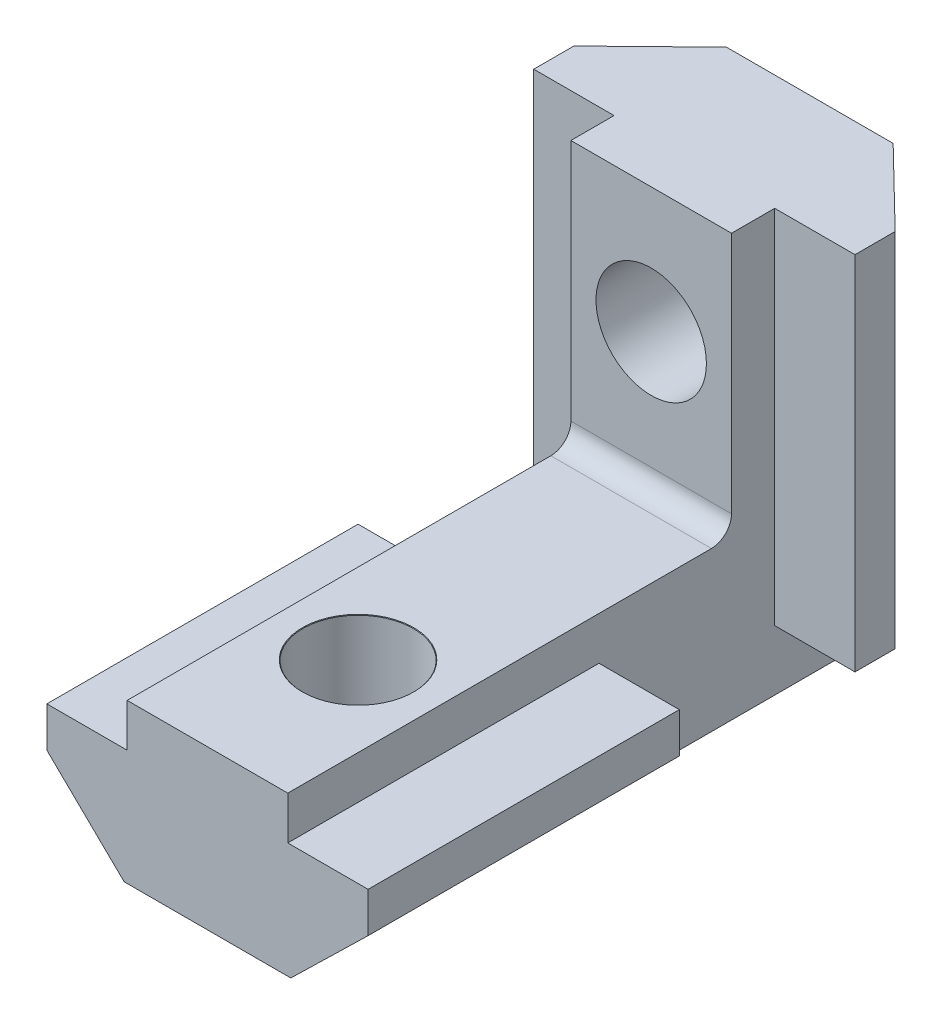
ISO-10303-21;
HEADER;
FILE_DESCRIPTION(('STEP AP214'),'2;1');
FILE_NAME('part.step','',(''),(''),'','','');
FILE_SCHEMA(('AUTOMOTIVE_DESIGN { 1 0 10303 214 1 1 1 1 }'));
ENDSEC;
DATA;
#1=APPLICATION_CONTEXT('core data for automotive mechanical design processes');
#2=APPLICATION_PROTOCOL_DEFINITION('international standard','automotive_design',2000,#1);
#3=PRODUCT_CONTEXT('',#1,'mechanical');
#4=PRODUCT('Part','Part','',(#3));
#5=PRODUCT_RELATED_PRODUCT_CATEGORY('part','',(#4));
#6=PRODUCT_DEFINITION_FORMATION('','',#4);
#7=PRODUCT_DEFINITION_CONTEXT('part definition',#1,'design');
#8=PRODUCT_DEFINITION('design','',#6,#7);
#9=PRODUCT_DEFINITION_SHAPE('','',#8);
#10=(LENGTH_UNIT() NAMED_UNIT(*) SI_UNIT(.MILLI.,.METRE.));
#11=(NAMED_UNIT(*) PLANE_ANGLE_UNIT() SI_UNIT($,.RADIAN.));
#12=(NAMED_UNIT(*) SI_UNIT($,.STERADIAN.) SOLID_ANGLE_UNIT());
#13=UNCERTAINTY_MEASURE_WITH_UNIT(LENGTH_MEASURE(1.E-05),#10,'distance_accuracy_value','');
#14=(GEOMETRIC_REPRESENTATION_CONTEXT(3) GLOBAL_UNCERTAINTY_ASSIGNED_CONTEXT((#13)) GLOBAL_UNIT_ASSIGNED_CONTEXT((#10,
#11,#12)) REPRESENTATION_CONTEXT('',''));
#15=CARTESIAN_POINT('',(0.,0.,0.));
#16=DIRECTION('',(0.,0.,1.));
#17=DIRECTION('',(1.,0.,0.));
#18=AXIS2_PLACEMENT_3D('',#15,#16,#17);
#19=CARTESIAN_POINT('',(-4.,7.9,-15.5));
#20=DIRECTION('',(-1.,0.,0.));
#21=DIRECTION('',(0.,0.,1.));
#22=AXIS2_PLACEMENT_3D('',#19,#20,#21);
#23=PLANE('',#22);
#24=DIRECTION('',(0.,0.,1.));
#25=VECTOR('',#24,1.);
#26=CARTESIAN_POINT('',(-4.,7.9,-15.5));
#27=LINE('',#26,#25);
#28=CARTESIAN_POINT('',(-4.,7.9,-21.1));
#29=VERTEX_POINT('',#28);
#30=CARTESIAN_POINT('',(-4.,7.9,0.));
#31=VERTEX_POINT('',#30);
#32=EDGE_CURVE('E303',#29,#31,#27,.T.);
#33=ORIENTED_EDGE('',*,*,#32,.F.);
#34=CARTESIAN_POINT('',(-4.,8.9,-21.1));
#35=DIRECTION('',(-1.,0.,0.));
#36=DIRECTION('',(0.,0.,1.));
#37=AXIS2_PLACEMENT_3D('',#34,#35,#36);
#38=CIRCLE('',#37,1.);
#39=CARTESIAN_POINT('',(-4.,8.9,-22.1));
#40=VERTEX_POINT('',#39);
#41=EDGE_CURVE('E41',#29,#40,#38,.F.);
#42=ORIENTED_EDGE('',*,*,#41,.T.);
#43=DIRECTION('',(0.,1.,0.));
#44=VECTOR('',#43,1.);
#45=CARTESIAN_POINT('',(-4.,-32.8440466262561,-22.1));
#46=LINE('',#45,#44);
#47=CARTESIAN_POINT('',(-4.,21.,-22.1));
#48=VERTEX_POINT('',#47);
#49=EDGE_CURVE('E245',#40,#48,#46,.T.);
#50=ORIENTED_EDGE('',*,*,#49,.T.);
#51=DIRECTION('',(0.,0.,-1.));
#52=VECTOR('',#51,1.);
#53=CARTESIAN_POINT('',(-4.,21.,-24.25));
#54=LINE('',#53,#52);
#55=CARTESIAN_POINT('',(-4.,21.,-24.25));
#56=VERTEX_POINT('',#55);
#57=EDGE_CURVE('E247',#48,#56,#54,.T.);
#58=ORIENTED_EDGE('',*,*,#57,.T.);
#59=DIRECTION('',(0.,1.,0.));
#60=VECTOR('',#59,1.);
#61=CARTESIAN_POINT('',(-4.,-32.8440466262561,-24.25));
#62=LINE('',#61,#60);
#63=CARTESIAN_POINT('',(-4.,3.,-24.25));
#64=VERTEX_POINT('',#63);
#65=EDGE_CURVE('E248',#64,#56,#62,.T.);
#66=ORIENTED_EDGE('',*,*,#65,.F.);
#67=DIRECTION('',(0.,0.,1.));
#68=VECTOR('',#67,1.);
#69=CARTESIAN_POINT('',(-4.,3.,-15.5));
#70=LINE('',#69,#68);
#71=CARTESIAN_POINT('',(-4.,3.,-30.));
#72=VERTEX_POINT('',#71);
#73=EDGE_CURVE('E216',#72,#64,#70,.T.);
#74=ORIENTED_EDGE('',*,*,#73,.F.);
#75=DIRECTION('',(0.,1.,0.));
#76=VECTOR('',#75,1.);
#77=CARTESIAN_POINT('',(-4.,0.,-30.));
#78=LINE('',#77,#76);
#79=CARTESIAN_POINT('',(-4.,0.,-30.));
#80=VERTEX_POINT('',#79);
#81=EDGE_CURVE('E203',#80,#72,#78,.T.);
#82=ORIENTED_EDGE('',*,*,#81,.F.);
#83=DIRECTION('',(0.,0.,1.));
#84=VECTOR('',#83,1.);
#85=CARTESIAN_POINT('',(-4.,0.,-30.));
#86=LINE('',#85,#84);
#87=CARTESIAN_POINT('',(-4.,0.,-15.5));
#88=VERTEX_POINT('',#87);
#89=EDGE_CURVE('E266',#80,#88,#86,.T.);
#90=ORIENTED_EDGE('',*,*,#89,.T.);
#91=DIRECTION('',(0.,1.,0.));
#92=VECTOR('',#91,1.);
#93=CARTESIAN_POINT('',(-4.,0.,-15.5));
#94=LINE('',#93,#92);
#95=CARTESIAN_POINT('',(-4.,5.75,-15.5));
#96=VERTEX_POINT('',#95);
#97=EDGE_CURVE('E260',#88,#96,#94,.T.);
#98=ORIENTED_EDGE('',*,*,#97,.T.);
#99=DIRECTION('',(0.,0.,1.));
#100=VECTOR('',#99,1.);
#101=CARTESIAN_POINT('',(-4.,5.75,-15.5));
#102=LINE('',#101,#100);
#103=CARTESIAN_POINT('',(-4.,5.75,0.));
#104=VERTEX_POINT('',#103);
#105=EDGE_CURVE('E300',#96,#104,#102,.T.);
#106=ORIENTED_EDGE('',*,*,#105,.T.);
#107=DIRECTION('',(0.,-1.,0.));
#108=VECTOR('',#107,1.);
#109=CARTESIAN_POINT('',(-4.,7.9,0.));
#110=LINE('',#109,#108);
#111=EDGE_CURVE('E326',#31,#104,#110,.T.);
#112=ORIENTED_EDGE('',*,*,#111,.F.);
#113=EDGE_LOOP('',(#33,#42,#50,#58,#66,#74,#82,#90,#98,#106,#112));
#114=FACE_BOUND('',#113,.T.);
#115=ADVANCED_FACE('F33',(#114),#23,.T.);
#116=CARTESIAN_POINT('',(4.,7.9,-15.5));
#117=DIRECTION('',(0.,1.,0.));
#118=DIRECTION('',(0.,0.,1.));
#119=AXIS2_PLACEMENT_3D('',#116,#117,#118);
#120=PLANE('',#119);
#121=CARTESIAN_POINT('',(0.,7.9,-7.5));
#122=DIRECTION('',(0.,1.,0.));
#123=DIRECTION('',(0.,0.,1.));
#124=AXIS2_PLACEMENT_3D('',#121,#122,#123);
#125=CIRCLE('',#124,2.775);
#126=CARTESIAN_POINT('',(0.,7.9,-4.725));
#127=VERTEX_POINT('',#126);
#128=EDGE_CURVE('E489',#127,#127,#125,.T.);
#129=ORIENTED_EDGE('',*,*,#128,.F.);
#130=EDGE_LOOP('',(#129));
#131=FACE_BOUND('',#130,.T.);
#132=DIRECTION('',(0.,0.,1.));
#133=VECTOR('',#132,1.);
#134=CARTESIAN_POINT('',(4.,7.9,-15.5));
#135=LINE('',#134,#133);
#136=CARTESIAN_POINT('',(4.,7.9,-21.1));
#137=VERTEX_POINT('',#136);
#138=CARTESIAN_POINT('',(4.,7.9,0.));
#139=VERTEX_POINT('',#138);
#140=EDGE_CURVE('E289',#137,#139,#135,.T.);
#141=ORIENTED_EDGE('',*,*,#140,.F.);
#142=DIRECTION('',(-1.,0.,0.));
#143=VECTOR('',#142,1.);
#144=CARTESIAN_POINT('',(4.,7.9,-21.1));
#145=LINE('',#144,#143);
#146=EDGE_CURVE('E276',#137,#29,#145,.T.);
#147=ORIENTED_EDGE('',*,*,#146,.T.);
#148=ORIENTED_EDGE('',*,*,#32,.T.);
#149=DIRECTION('',(-1.,0.,0.));
#150=VECTOR('',#149,1.);
#151=CARTESIAN_POINT('',(4.,7.9,0.));
#152=LINE('',#151,#150);
#153=EDGE_CURVE('E370',#139,#31,#152,.T.);
#154=ORIENTED_EDGE('',*,*,#153,.F.);
#155=EDGE_LOOP('',(#141,#147,#148,#154));
#156=FACE_BOUND('',#155,.T.);
#157=ADVANCED_FACE('F320',(#131,#156),#120,.T.);
#158=CARTESIAN_POINT('',(4.,5.75,-15.5));
#159=DIRECTION('',(1.,0.,0.));
#160=DIRECTION('',(0.,0.,-1.));
#161=AXIS2_PLACEMENT_3D('',#158,#159,#160);
#162=PLANE('',#161);
#163=DIRECTION('',(0.,1.,0.));
#164=VECTOR('',#163,1.);
#165=CARTESIAN_POINT('',(4.,-32.8440466262561,-24.25));
#166=LINE('',#165,#164);
#167=CARTESIAN_POINT('',(4.,3.,-24.25));
#168=VERTEX_POINT('',#167);
#169=CARTESIAN_POINT('',(4.,21.,-24.25));
#170=VERTEX_POINT('',#169);
#171=EDGE_CURVE('E239',#168,#170,#166,.T.);
#172=ORIENTED_EDGE('',*,*,#171,.T.);
#173=DIRECTION('',(0.,0.,1.));
#174=VECTOR('',#173,1.);
#175=CARTESIAN_POINT('',(4.,21.,-22.1));
#176=LINE('',#175,#174);
#177=CARTESIAN_POINT('',(4.,21.,-22.1));
#178=VERTEX_POINT('',#177);
#179=EDGE_CURVE('E241',#170,#178,#176,.T.);
#180=ORIENTED_EDGE('',*,*,#179,.T.);
#181=DIRECTION('',(0.,1.,0.));
#182=VECTOR('',#181,1.);
#183=CARTESIAN_POINT('',(4.,-32.8440466262561,-22.1));
#184=LINE('',#183,#182);
#185=CARTESIAN_POINT('',(4.,8.9,-22.1));
#186=VERTEX_POINT('',#185);
#187=EDGE_CURVE('E242',#186,#178,#184,.T.);
#188=ORIENTED_EDGE('',*,*,#187,.F.);
#189=CARTESIAN_POINT('',(4.,8.9,-21.1));
#190=DIRECTION('',(1.,0.,0.));
#191=DIRECTION('',(0.,0.,-1.));
#192=AXIS2_PLACEMENT_3D('',#189,#190,#191);
#193=CIRCLE('',#192,1.);
#194=EDGE_CURVE('E12',#186,#137,#193,.F.);
#195=ORIENTED_EDGE('',*,*,#194,.T.);
#196=ORIENTED_EDGE('',*,*,#140,.T.);
#197=DIRECTION('',(0.,1.,0.));
#198=VECTOR('',#197,1.);
#199=CARTESIAN_POINT('',(4.,5.75,0.));
#200=LINE('',#199,#198);
#201=CARTESIAN_POINT('',(4.,5.75,0.));
#202=VERTEX_POINT('',#201);
#203=EDGE_CURVE('E367',#202,#139,#200,.T.);
#204=ORIENTED_EDGE('',*,*,#203,.F.);
#205=DIRECTION('',(0.,0.,1.));
#206=VECTOR('',#205,1.);
#207=CARTESIAN_POINT('',(4.,5.75,-15.5));
#208=LINE('',#207,#206);
#209=CARTESIAN_POINT('',(4.,5.75,-15.5));
#210=VERTEX_POINT('',#209);
#211=EDGE_CURVE('E287',#210,#202,#208,.T.);
#212=ORIENTED_EDGE('',*,*,#211,.F.);
#213=DIRECTION('',(0.,-1.,0.));
#214=VECTOR('',#213,1.);
#215=CARTESIAN_POINT('',(4.,7.9,-15.5));
#216=LINE('',#215,#214);
#217=CARTESIAN_POINT('',(4.,0.,-15.5));
#218=VERTEX_POINT('',#217);
#219=EDGE_CURVE('E272',#210,#218,#216,.T.);
#220=ORIENTED_EDGE('',*,*,#219,.T.);
#221=DIRECTION('',(0.,0.,1.));
#222=VECTOR('',#221,1.);
#223=CARTESIAN_POINT('',(4.,0.,-30.));
#224=LINE('',#223,#222);
#225=CARTESIAN_POINT('',(4.,0.,-30.));
#226=VERTEX_POINT('',#225);
#227=EDGE_CURVE('E281',#226,#218,#224,.T.);
#228=ORIENTED_EDGE('',*,*,#227,.F.);
#229=DIRECTION('',(0.,-1.,0.));
#230=VECTOR('',#229,1.);
#231=CARTESIAN_POINT('',(4.,7.9,-30.));
#232=LINE('',#231,#230);
#233=CARTESIAN_POINT('',(4.,3.,-30.));
#234=VERTEX_POINT('',#233);
#235=EDGE_CURVE('E261',#234,#226,#232,.T.);
#236=ORIENTED_EDGE('',*,*,#235,.F.);
#237=DIRECTION('',(0.,0.,-1.));
#238=VECTOR('',#237,1.);
#239=CARTESIAN_POINT('',(4.,3.,-15.5));
#240=LINE('',#239,#238);
#241=EDGE_CURVE('E213',#168,#234,#240,.T.);
#242=ORIENTED_EDGE('',*,*,#241,.F.);
#243=EDGE_LOOP('',(#172,#180,#188,#195,#196,#204,#212,#220,#228,#236,#242));
#244=FACE_BOUND('',#243,.T.);
#245=ADVANCED_FACE('F406',(#244),#162,.T.);
#246=CARTESIAN_POINT('',(0.,0.,-15.5));
#247=DIRECTION('',(0.,0.,-1.));
#248=DIRECTION('',(-1.,0.,0.));
#249=AXIS2_PLACEMENT_3D('',#246,#247,#248);
#250=PLANE('',#249);
#251=ORIENTED_EDGE('',*,*,#97,.F.);
#252=DIRECTION('',(1.,0.,0.));
#253=VECTOR('',#252,1.);
#254=CARTESIAN_POINT('',(-4.15,0.,-15.5));
#255=LINE('',#254,#253);
#256=CARTESIAN_POINT('',(-4.15,0.,-15.5));
#257=VERTEX_POINT('',#256);
#258=EDGE_CURVE('E339',#257,#88,#255,.T.);
#259=ORIENTED_EDGE('',*,*,#258,.F.);
#260=DIRECTION('',(0.7163488096607,-0.697742347072111,0.));
#261=VECTOR('',#260,1.);
#262=CARTESIAN_POINT('',(-4.15,0.,-15.5));
#263=LINE('',#262,#261);
#264=CARTESIAN_POINT('',(-8.,3.75,-15.5));
#265=VERTEX_POINT('',#264);
#266=EDGE_CURVE('E345',#265,#257,#263,.T.);
#267=ORIENTED_EDGE('',*,*,#266,.F.);
#268=DIRECTION('',(0.,-1.,0.));
#269=VECTOR('',#268,1.);
#270=CARTESIAN_POINT('',(-8.,3.75,-15.5));
#271=LINE('',#270,#269);
#272=CARTESIAN_POINT('',(-8.,5.75,-15.5));
#273=VERTEX_POINT('',#272);
#274=EDGE_CURVE('E308',#273,#265,#271,.T.);
#275=ORIENTED_EDGE('',*,*,#274,.F.);
#276=DIRECTION('',(-1.,0.,0.));
#277=VECTOR('',#276,1.);
#278=CARTESIAN_POINT('',(-4.,5.75,-15.5));
#279=LINE('',#278,#277);
#280=EDGE_CURVE('E296',#96,#273,#279,.T.);
#281=ORIENTED_EDGE('',*,*,#280,.F.);
#282=EDGE_LOOP('',(#251,#259,#267,#275,#281));
#283=FACE_BOUND('',#282,.T.);
#284=ADVANCED_FACE('F398',(#283),#250,.T.);
#285=CARTESIAN_POINT('',(-4.15,0.,-15.5));
#286=DIRECTION('',(-0.697742347072111,-0.7163488096607,0.));
#287=DIRECTION('',(0.7163488096607,-0.697742347072111,0.));
#288=AXIS2_PLACEMENT_3D('',#285,#286,#287);
#289=PLANE('',#288);
#290=DIRECTION('',(0.7163488096607,-0.697742347072111,0.));
#291=VECTOR('',#290,1.);
#292=CARTESIAN_POINT('',(-4.15,0.,0.));
#293=LINE('',#292,#291);
#294=CARTESIAN_POINT('',(-8.,3.75,0.));
#295=VERTEX_POINT('',#294);
#296=CARTESIAN_POINT('',(-4.15,0.,0.));
#297=VERTEX_POINT('',#296);
#298=EDGE_CURVE('E284',#295,#297,#293,.T.);
#299=ORIENTED_EDGE('',*,*,#298,.F.);
#300=DIRECTION('',(0.,0.,1.));
#301=VECTOR('',#300,1.);
#302=CARTESIAN_POINT('',(-8.,3.75,-15.5));
#303=LINE('',#302,#301);
#304=EDGE_CURVE('E277',#265,#295,#303,.T.);
#305=ORIENTED_EDGE('',*,*,#304,.F.);
#306=ORIENTED_EDGE('',*,*,#266,.T.);
#307=DIRECTION('',(0.,0.,1.));
#308=VECTOR('',#307,1.);
#309=CARTESIAN_POINT('',(-4.15,0.,-15.5));
#310=LINE('',#309,#308);
#311=EDGE_CURVE('E338',#257,#297,#310,.T.);
#312=ORIENTED_EDGE('',*,*,#311,.T.);
#313=EDGE_LOOP('',(#299,#305,#306,#312));
#314=FACE_BOUND('',#313,.T.);
#315=ADVANCED_FACE('F390',(#314),#289,.T.);
#316=CARTESIAN_POINT('',(-8.,3.75,-15.5));
#317=DIRECTION('',(-1.,0.,0.));
#318=DIRECTION('',(0.,0.,1.));
#319=AXIS2_PLACEMENT_3D('',#316,#317,#318);
#320=PLANE('',#319);
#321=DIRECTION('',(0.,-1.,0.));
#322=VECTOR('',#321,1.);
#323=CARTESIAN_POINT('',(-8.,3.75,0.));
#324=LINE('',#323,#322);
#325=CARTESIAN_POINT('',(-8.,5.75,0.));
#326=VERTEX_POINT('',#325);
#327=EDGE_CURVE('E376',#326,#295,#324,.T.);
#328=ORIENTED_EDGE('',*,*,#327,.F.);
#329=DIRECTION('',(0.,0.,1.));
#330=VECTOR('',#329,1.);
#331=CARTESIAN_POINT('',(-8.,5.75,-15.5));
#332=LINE('',#331,#330);
#333=EDGE_CURVE('E302',#273,#326,#332,.T.);
#334=ORIENTED_EDGE('',*,*,#333,.F.);
#335=ORIENTED_EDGE('',*,*,#274,.T.);
#336=ORIENTED_EDGE('',*,*,#304,.T.);
#337=EDGE_LOOP('',(#328,#334,#335,#336));
#338=FACE_BOUND('',#337,.T.);
#339=ADVANCED_FACE('F388',(#338),#320,.T.);
#340=CARTESIAN_POINT('',(-4.,5.75,-15.5));
#341=DIRECTION('',(0.,1.,0.));
#342=DIRECTION('',(0.,0.,1.));
#343=AXIS2_PLACEMENT_3D('',#340,#341,#342);
#344=PLANE('',#343);
#345=DIRECTION('',(-1.,0.,0.));
#346=VECTOR('',#345,1.);
#347=CARTESIAN_POINT('',(-4.,5.75,0.));
#348=LINE('',#347,#346);
#349=EDGE_CURVE('E373',#104,#326,#348,.T.);
#350=ORIENTED_EDGE('',*,*,#349,.F.);
#351=ORIENTED_EDGE('',*,*,#105,.F.);
#352=ORIENTED_EDGE('',*,*,#280,.T.);
#353=ORIENTED_EDGE('',*,*,#333,.T.);
#354=EDGE_LOOP('',(#350,#351,#352,#353));
#355=FACE_BOUND('',#354,.T.);
#356=ADVANCED_FACE('F383',(#355),#344,.T.);
#357=CARTESIAN_POINT('',(8.,5.75,-15.5));
#358=DIRECTION('',(0.,1.,0.));
#359=DIRECTION('',(0.,0.,1.));
#360=AXIS2_PLACEMENT_3D('',#357,#358,#359);
#361=PLANE('',#360);
#362=DIRECTION('',(-1.,0.,0.));
#363=VECTOR('',#362,1.);
#364=CARTESIAN_POINT('',(8.,5.75,0.));
#365=LINE('',#364,#363);
#366=CARTESIAN_POINT('',(8.,5.75,0.));
#367=VERTEX_POINT('',#366);
#368=EDGE_CURVE('E364',#367,#202,#365,.T.);
#369=ORIENTED_EDGE('',*,*,#368,.F.);
#370=DIRECTION('',(0.,0.,1.));
#371=VECTOR('',#370,1.);
#372=CARTESIAN_POINT('',(8.,5.75,-15.5));
#373=LINE('',#372,#371);
#374=CARTESIAN_POINT('',(8.,5.75,-15.5));
#375=VERTEX_POINT('',#374);
#376=EDGE_CURVE('E290',#375,#367,#373,.T.);
#377=ORIENTED_EDGE('',*,*,#376,.F.);
#378=DIRECTION('',(-1.,0.,0.));
#379=VECTOR('',#378,1.);
#380=CARTESIAN_POINT('',(8.,5.75,-15.5));
#381=LINE('',#380,#379);
#382=EDGE_CURVE('E293',#375,#210,#381,.T.);
#383=ORIENTED_EDGE('',*,*,#382,.T.);
#384=ORIENTED_EDGE('',*,*,#211,.T.);
#385=EDGE_LOOP('',(#369,#377,#383,#384));
#386=FACE_BOUND('',#385,.T.);
#387=ADVANCED_FACE('F396',(#386),#361,.T.);
#388=CARTESIAN_POINT('',(8.,3.75,-15.5));
#389=DIRECTION('',(1.,0.,0.));
#390=DIRECTION('',(0.,0.,-1.));
#391=AXIS2_PLACEMENT_3D('',#388,#389,#390);
#392=PLANE('',#391);
#393=DIRECTION('',(0.,1.,0.));
#394=VECTOR('',#393,1.);
#395=CARTESIAN_POINT('',(8.,3.75,0.));
#396=LINE('',#395,#394);
#397=CARTESIAN_POINT('',(8.,3.75,0.));
#398=VERTEX_POINT('',#397);
#399=EDGE_CURVE('E361',#398,#367,#396,.T.);
#400=ORIENTED_EDGE('',*,*,#399,.F.);
#401=DIRECTION('',(0.,0.,1.));
#402=VECTOR('',#401,1.);
#403=CARTESIAN_POINT('',(8.,3.75,-15.5));
#404=LINE('',#403,#402);
#405=CARTESIAN_POINT('',(8.,3.75,-15.5));
#406=VERTEX_POINT('',#405);
#407=EDGE_CURVE('E334',#406,#398,#404,.T.);
#408=ORIENTED_EDGE('',*,*,#407,.F.);
#409=DIRECTION('',(0.,1.,0.));
#410=VECTOR('',#409,1.);
#411=CARTESIAN_POINT('',(8.,3.75,-15.5));
#412=LINE('',#411,#410);
#413=EDGE_CURVE('E297',#406,#375,#412,.T.);
#414=ORIENTED_EDGE('',*,*,#413,.T.);
#415=ORIENTED_EDGE('',*,*,#376,.T.);
#416=EDGE_LOOP('',(#400,#408,#414,#415));
#417=FACE_BOUND('',#416,.T.);
#418=ADVANCED_FACE('F415',(#417),#392,.T.);
#419=CARTESIAN_POINT('',(4.15,0.,-15.5));
#420=DIRECTION('',(0.697742347072111,-0.7163488096607,0.));
#421=DIRECTION('',(0.7163488096607,0.697742347072111,0.));
#422=AXIS2_PLACEMENT_3D('',#419,#420,#421);
#423=PLANE('',#422);
#424=DIRECTION('',(0.7163488096607,0.697742347072111,0.));
#425=VECTOR('',#424,1.);
#426=CARTESIAN_POINT('',(4.15,0.,0.));
#427=LINE('',#426,#425);
#428=CARTESIAN_POINT('',(4.15,0.,0.));
#429=VERTEX_POINT('',#428);
#430=EDGE_CURVE('E358',#429,#398,#427,.T.);
#431=ORIENTED_EDGE('',*,*,#430,.F.);
#432=DIRECTION('',(0.,0.,1.));
#433=VECTOR('',#432,1.);
#434=CARTESIAN_POINT('',(4.15,0.,-15.5));
#435=LINE('',#434,#433);
#436=CARTESIAN_POINT('',(4.15,0.,-15.5));
#437=VERTEX_POINT('',#436);
#438=EDGE_CURVE('E336',#437,#429,#435,.T.);
#439=ORIENTED_EDGE('',*,*,#438,.F.);
#440=DIRECTION('',(0.7163488096607,0.697742347072111,0.));
#441=VECTOR('',#440,1.);
#442=CARTESIAN_POINT('',(4.15,0.,-15.5));
#443=LINE('',#442,#441);
#444=EDGE_CURVE('E341',#437,#406,#443,.T.);
#445=ORIENTED_EDGE('',*,*,#444,.T.);
#446=ORIENTED_EDGE('',*,*,#407,.T.);
#447=EDGE_LOOP('',(#431,#439,#445,#446));
#448=FACE_BOUND('',#447,.T.);
#449=ADVANCED_FACE('F419',(#448),#423,.T.);
#450=CARTESIAN_POINT('',(-4.15,0.,-15.5));
#451=DIRECTION('',(0.,-1.,0.));
#452=DIRECTION('',(0.,0.,-1.));
#453=AXIS2_PLACEMENT_3D('',#450,#451,#452);
#454=PLANE('',#453);
#455=CARTESIAN_POINT('',(0.,0.,-7.5));
#456=DIRECTION('',(0.,-1.,0.));
#457=DIRECTION('',(0.,0.,-1.));
#458=AXIS2_PLACEMENT_3D('',#455,#456,#457);
#459=CIRCLE('',#458,2.75);
#460=CARTESIAN_POINT('',(0.,0.,-10.25));
#461=VERTEX_POINT('',#460);
#462=EDGE_CURVE('E257',#461,#461,#459,.T.);
#463=ORIENTED_EDGE('',*,*,#462,.F.);
#464=EDGE_LOOP('',(#463));
#465=FACE_BOUND('',#464,.T.);
#466=DIRECTION('',(1.,0.,0.));
#467=VECTOR('',#466,1.);
#468=CARTESIAN_POINT('',(-4.15,0.,0.));
#469=LINE('',#468,#467);
#470=EDGE_CURVE('E355',#297,#429,#469,.T.);
#471=ORIENTED_EDGE('',*,*,#470,.F.);
#472=ORIENTED_EDGE('',*,*,#311,.F.);
#473=ORIENTED_EDGE('',*,*,#258,.T.);
#474=ORIENTED_EDGE('',*,*,#89,.F.);
#475=DIRECTION('',(-1.,0.,0.));
#476=VECTOR('',#475,1.);
#477=CARTESIAN_POINT('',(4.,0.,-30.));
#478=LINE('',#477,#476);
#479=EDGE_CURVE('E263',#226,#80,#478,.T.);
#480=ORIENTED_EDGE('',*,*,#479,.F.);
#481=ORIENTED_EDGE('',*,*,#227,.T.);
#482=EDGE_CURVE('E278',#218,#437,#255,.T.);
#483=ORIENTED_EDGE('',*,*,#482,.T.);
#484=ORIENTED_EDGE('',*,*,#438,.T.);
#485=EDGE_LOOP('',(#471,#472,#473,#474,#480,#481,#483,#484));
#486=FACE_BOUND('',#485,.T.);
#487=ADVANCED_FACE('F423',(#465,#486),#454,.T.);
#488=ORIENTED_EDGE('',*,*,#219,.F.);
#489=ORIENTED_EDGE('',*,*,#382,.F.);
#490=ORIENTED_EDGE('',*,*,#413,.F.);
#491=ORIENTED_EDGE('',*,*,#444,.F.);
#492=ORIENTED_EDGE('',*,*,#482,.F.);
#493=EDGE_LOOP('',(#488,#489,#490,#491,#492));
#494=FACE_BOUND('',#493,.T.);
#495=ADVANCED_FACE('F426',(#494),#250,.T.);
#496=CARTESIAN_POINT('',(0.,0.,0.));
#497=DIRECTION('',(0.,0.,-1.));
#498=DIRECTION('',(-1.,0.,0.));
#499=AXIS2_PLACEMENT_3D('',#496,#497,#498);
#500=PLANE('',#499);
#501=ORIENTED_EDGE('',*,*,#298,.T.);
#502=ORIENTED_EDGE('',*,*,#470,.T.);
#503=ORIENTED_EDGE('',*,*,#430,.T.);
#504=ORIENTED_EDGE('',*,*,#399,.T.);
#505=ORIENTED_EDGE('',*,*,#368,.T.);
#506=ORIENTED_EDGE('',*,*,#203,.T.);
#507=ORIENTED_EDGE('',*,*,#153,.T.);
#508=ORIENTED_EDGE('',*,*,#111,.T.);
#509=ORIENTED_EDGE('',*,*,#349,.T.);
#510=ORIENTED_EDGE('',*,*,#327,.T.);
#511=EDGE_LOOP('',(#501,#502,#503,#504,#505,#506,#507,#508,#509,#510));
#512=FACE_BOUND('',#511,.T.);
#513=ADVANCED_FACE('F387',(#512),#500,.F.);
#514=CARTESIAN_POINT('',(0.,0.,-30.));
#515=DIRECTION('',(0.,0.,-1.));
#516=DIRECTION('',(-1.,0.,0.));
#517=AXIS2_PLACEMENT_3D('',#514,#515,#516);
#518=PLANE('',#517);
#519=CARTESIAN_POINT('',(0.,14.75,-30.));
#520=DIRECTION('',(0.,0.,-1.));
#521=DIRECTION('',(-1.,0.,0.));
#522=AXIS2_PLACEMENT_3D('',#519,#520,#521);
#523=CIRCLE('',#522,2.75);
#524=CARTESIAN_POINT('',(-2.75,14.75,-30.));
#525=VERTEX_POINT('',#524);
#526=EDGE_CURVE('E487',#525,#525,#523,.T.);
#527=ORIENTED_EDGE('',*,*,#526,.F.);
#528=EDGE_LOOP('',(#527));
#529=FACE_BOUND('',#528,.T.);
#530=ORIENTED_EDGE('',*,*,#81,.T.);
#531=DIRECTION('',(1.,0.,0.));
#532=VECTOR('',#531,1.);
#533=CARTESIAN_POINT('',(4.15,3.,-30.));
#534=LINE('',#533,#532);
#535=CARTESIAN_POINT('',(-4.15,3.,-30.));
#536=VERTEX_POINT('',#535);
#537=EDGE_CURVE('E200',#536,#72,#534,.T.);
#538=ORIENTED_EDGE('',*,*,#537,.F.);
#539=DIRECTION('',(0.,1.,0.));
#540=VECTOR('',#539,1.);
#541=CARTESIAN_POINT('',(-4.15,-32.8440466262561,-30.));
#542=LINE('',#541,#540);
#543=CARTESIAN_POINT('',(-4.15,21.,-30.));
#544=VERTEX_POINT('',#543);
#545=EDGE_CURVE('E185',#536,#544,#542,.T.);
#546=ORIENTED_EDGE('',*,*,#545,.T.);
#547=DIRECTION('',(1.,0.,0.));
#548=VECTOR('',#547,1.);
#549=CARTESIAN_POINT('',(4.15,21.,-30.));
#550=LINE('',#549,#548);
#551=CARTESIAN_POINT('',(4.15,21.,-30.));
#552=VERTEX_POINT('',#551);
#553=EDGE_CURVE('E196',#544,#552,#550,.T.);
#554=ORIENTED_EDGE('',*,*,#553,.T.);
#555=DIRECTION('',(0.,1.,0.));
#556=VECTOR('',#555,1.);
#557=CARTESIAN_POINT('',(4.15,-32.8440466262561,-30.));
#558=LINE('',#557,#556);
#559=CARTESIAN_POINT('',(4.15,3.,-30.));
#560=VERTEX_POINT('',#559);
#561=EDGE_CURVE('E256',#560,#552,#558,.T.);
#562=ORIENTED_EDGE('',*,*,#561,.F.);
#563=EDGE_CURVE('E207',#234,#560,#534,.T.);
#564=ORIENTED_EDGE('',*,*,#563,.F.);
#565=ORIENTED_EDGE('',*,*,#235,.T.);
#566=ORIENTED_EDGE('',*,*,#479,.T.);
#567=EDGE_LOOP('',(#530,#538,#546,#554,#562,#564,#565,#566));
#568=FACE_BOUND('',#567,.T.);
#569=ADVANCED_FACE('F201',(#529,#568),#518,.T.);
#570=CARTESIAN_POINT('',(0.,3.,0.));
#571=DIRECTION('',(0.,-1.,0.));
#572=DIRECTION('',(0.,0.,-1.));
#573=AXIS2_PLACEMENT_3D('',#570,#571,#572);
#574=PLANE('',#573);
#575=ORIENTED_EDGE('',*,*,#537,.T.);
#576=ORIENTED_EDGE('',*,*,#73,.T.);
#577=DIRECTION('',(-1.,0.,0.));
#578=VECTOR('',#577,1.);
#579=CARTESIAN_POINT('',(-8.,3.,-24.25));
#580=LINE('',#579,#578);
#581=CARTESIAN_POINT('',(-8.,3.,-24.25));
#582=VERTEX_POINT('',#581);
#583=EDGE_CURVE('E218',#64,#582,#580,.T.);
#584=ORIENTED_EDGE('',*,*,#583,.T.);
#585=DIRECTION('',(0.,0.,-1.));
#586=VECTOR('',#585,1.);
#587=CARTESIAN_POINT('',(-8.,3.,-24.25));
#588=LINE('',#587,#586);
#589=CARTESIAN_POINT('',(-8.,3.,-26.25));
#590=VERTEX_POINT('',#589);
#591=EDGE_CURVE('E212',#582,#590,#588,.T.);
#592=ORIENTED_EDGE('',*,*,#591,.T.);
#593=DIRECTION('',(0.7163488096607,0.,-0.697742347072111));
#594=VECTOR('',#593,1.);
#595=CARTESIAN_POINT('',(-4.15,3.,-30.));
#596=LINE('',#595,#594);
#597=EDGE_CURVE('E189',#590,#536,#596,.T.);
#598=ORIENTED_EDGE('',*,*,#597,.T.);
#599=EDGE_LOOP('',(#575,#576,#584,#592,#598));
#600=FACE_BOUND('',#599,.T.);
#601=ADVANCED_FACE('F210',(#600),#574,.T.);
#602=CARTESIAN_POINT('',(4.15,-32.8440466262561,-30.));
#603=DIRECTION('',(-0.697742347072111,0.,0.7163488096607));
#604=DIRECTION('',(0.7163488096607,0.,0.697742347072111));
#605=AXIS2_PLACEMENT_3D('',#602,#603,#604);
#606=PLANE('',#605);
#607=DIRECTION('',(0.7163488096607,0.,0.697742347072111));
#608=VECTOR('',#607,1.);
#609=CARTESIAN_POINT('',(4.15,3.,-30.));
#610=LINE('',#609,#608);
#611=CARTESIAN_POINT('',(8.,3.,-26.25));
#612=VERTEX_POINT('',#611);
#613=EDGE_CURVE('E206',#560,#612,#610,.T.);
#614=ORIENTED_EDGE('',*,*,#613,.F.);
#615=ORIENTED_EDGE('',*,*,#561,.T.);
#616=DIRECTION('',(0.7163488096607,0.,0.697742347072111));
#617=VECTOR('',#616,1.);
#618=CARTESIAN_POINT('',(4.15,21.,-30.));
#619=LINE('',#618,#617);
#620=CARTESIAN_POINT('',(8.,21.,-26.25));
#621=VERTEX_POINT('',#620);
#622=EDGE_CURVE('E221',#552,#621,#619,.T.);
#623=ORIENTED_EDGE('',*,*,#622,.T.);
#624=DIRECTION('',(0.,1.,0.));
#625=VECTOR('',#624,1.);
#626=CARTESIAN_POINT('',(8.,-32.8440466262561,-26.25));
#627=LINE('',#626,#625);
#628=EDGE_CURVE('E233',#612,#621,#627,.T.);
#629=ORIENTED_EDGE('',*,*,#628,.F.);
#630=EDGE_LOOP('',(#614,#615,#623,#629));
#631=FACE_BOUND('',#630,.T.);
#632=ADVANCED_FACE('F474',(#631),#606,.F.);
#633=CARTESIAN_POINT('',(8.,-32.8440466262561,-24.25));
#634=DIRECTION('',(-1.,0.,0.));
#635=DIRECTION('',(0.,0.,1.));
#636=AXIS2_PLACEMENT_3D('',#633,#634,#635);
#637=PLANE('',#636);
#638=DIRECTION('',(0.,0.,1.));
#639=VECTOR('',#638,1.);
#640=CARTESIAN_POINT('',(8.,3.,-24.25));
#641=LINE('',#640,#639);
#642=CARTESIAN_POINT('',(8.,3.,-24.25));
#643=VERTEX_POINT('',#642);
#644=EDGE_CURVE('E228',#612,#643,#641,.T.);
#645=ORIENTED_EDGE('',*,*,#644,.F.);
#646=ORIENTED_EDGE('',*,*,#628,.T.);
#647=DIRECTION('',(0.,0.,1.));
#648=VECTOR('',#647,1.);
#649=CARTESIAN_POINT('',(8.,21.,-24.25));
#650=LINE('',#649,#648);
#651=CARTESIAN_POINT('',(8.,21.,-24.25));
#652=VERTEX_POINT('',#651);
#653=EDGE_CURVE('E235',#621,#652,#650,.T.);
#654=ORIENTED_EDGE('',*,*,#653,.T.);
#655=DIRECTION('',(0.,1.,0.));
#656=VECTOR('',#655,1.);
#657=CARTESIAN_POINT('',(8.,-32.8440466262561,-24.25));
#658=LINE('',#657,#656);
#659=EDGE_CURVE('E236',#643,#652,#658,.T.);
#660=ORIENTED_EDGE('',*,*,#659,.F.);
#661=EDGE_LOOP('',(#645,#646,#654,#660));
#662=FACE_BOUND('',#661,.T.);
#663=ADVANCED_FACE('F479',(#662),#637,.F.);
#664=CARTESIAN_POINT('',(4.,-32.8440466262561,-24.25));
#665=DIRECTION('',(0.,0.,-1.));
#666=DIRECTION('',(-1.,0.,0.));
#667=AXIS2_PLACEMENT_3D('',#664,#665,#666);
#668=PLANE('',#667);
#669=DIRECTION('',(-1.,0.,0.));
#670=VECTOR('',#669,1.);
#671=CARTESIAN_POINT('',(4.,3.,-24.25));
#672=LINE('',#671,#670);
#673=EDGE_CURVE('E225',#643,#168,#672,.T.);
#674=ORIENTED_EDGE('',*,*,#673,.F.);
#675=ORIENTED_EDGE('',*,*,#659,.T.);
#676=DIRECTION('',(-1.,0.,0.));
#677=VECTOR('',#676,1.);
#678=CARTESIAN_POINT('',(4.,21.,-24.25));
#679=LINE('',#678,#677);
#680=EDGE_CURVE('E238',#652,#170,#679,.T.);
#681=ORIENTED_EDGE('',*,*,#680,.T.);
#682=ORIENTED_EDGE('',*,*,#171,.F.);
#683=EDGE_LOOP('',(#674,#675,#681,#682));
#684=FACE_BOUND('',#683,.T.);
#685=ADVANCED_FACE('F525',(#684),#668,.F.);
#686=CARTESIAN_POINT('',(-4.,-32.8440466262561,-22.1));
#687=DIRECTION('',(0.,0.,-1.));
#688=DIRECTION('',(-1.,0.,0.));
#689=AXIS2_PLACEMENT_3D('',#686,#687,#688);
#690=PLANE('',#689);
#691=CARTESIAN_POINT('',(0.,14.75,-22.1));
#692=DIRECTION('',(0.,0.,1.));
#693=DIRECTION('',(1.,0.,0.));
#694=AXIS2_PLACEMENT_3D('',#691,#692,#693);
#695=CIRCLE('',#694,2.75);
#696=CARTESIAN_POINT('',(2.75,14.75,-22.1));
#697=VERTEX_POINT('',#696);
#698=EDGE_CURVE('E490',#697,#697,#695,.T.);
#699=ORIENTED_EDGE('',*,*,#698,.F.);
#700=EDGE_LOOP('',(#699));
#701=FACE_BOUND('',#700,.T.);
#702=ORIENTED_EDGE('',*,*,#49,.F.);
#703=DIRECTION('',(-1.,0.,0.));
#704=VECTOR('',#703,1.);
#705=CARTESIAN_POINT('',(-4.,8.9,-22.1));
#706=LINE('',#705,#704);
#707=EDGE_CURVE('E54',#40,#186,#706,.F.);
#708=ORIENTED_EDGE('',*,*,#707,.T.);
#709=ORIENTED_EDGE('',*,*,#187,.T.);
#710=DIRECTION('',(-1.,0.,0.));
#711=VECTOR('',#710,1.);
#712=CARTESIAN_POINT('',(-4.,21.,-22.1));
#713=LINE('',#712,#711);
#714=EDGE_CURVE('E244',#178,#48,#713,.T.);
#715=ORIENTED_EDGE('',*,*,#714,.T.);
#716=EDGE_LOOP('',(#702,#708,#709,#715));
#717=FACE_BOUND('',#716,.T.);
#718=ADVANCED_FACE('F540',(#701,#717),#690,.F.);
#719=CARTESIAN_POINT('',(-8.,-32.8440466262561,-24.25));
#720=DIRECTION('',(0.,0.,-1.));
#721=DIRECTION('',(-1.,0.,0.));
#722=AXIS2_PLACEMENT_3D('',#719,#720,#721);
#723=PLANE('',#722);
#724=ORIENTED_EDGE('',*,*,#583,.F.);
#725=ORIENTED_EDGE('',*,*,#65,.T.);
#726=DIRECTION('',(-1.,0.,0.));
#727=VECTOR('',#726,1.);
#728=CARTESIAN_POINT('',(-8.,21.,-24.25));
#729=LINE('',#728,#727);
#730=CARTESIAN_POINT('',(-8.,21.,-24.25));
#731=VERTEX_POINT('',#730);
#732=EDGE_CURVE('E250',#56,#731,#729,.T.);
#733=ORIENTED_EDGE('',*,*,#732,.T.);
#734=DIRECTION('',(0.,1.,0.));
#735=VECTOR('',#734,1.);
#736=CARTESIAN_POINT('',(-8.,-32.8440466262561,-24.25));
#737=LINE('',#736,#735);
#738=EDGE_CURVE('E251',#582,#731,#737,.T.);
#739=ORIENTED_EDGE('',*,*,#738,.F.);
#740=EDGE_LOOP('',(#724,#725,#733,#739));
#741=FACE_BOUND('',#740,.T.);
#742=ADVANCED_FACE('F535',(#741),#723,.F.);
#743=CARTESIAN_POINT('',(-8.,-32.8440466262561,-24.25));
#744=DIRECTION('',(1.,0.,0.));
#745=DIRECTION('',(0.,0.,-1.));
#746=AXIS2_PLACEMENT_3D('',#743,#744,#745);
#747=PLANE('',#746);
#748=ORIENTED_EDGE('',*,*,#591,.F.);
#749=ORIENTED_EDGE('',*,*,#738,.T.);
#750=DIRECTION('',(0.,0.,-1.));
#751=VECTOR('',#750,1.);
#752=CARTESIAN_POINT('',(-8.,21.,-24.25));
#753=LINE('',#752,#751);
#754=CARTESIAN_POINT('',(-8.,21.,-26.25));
#755=VERTEX_POINT('',#754);
#756=EDGE_CURVE('E253',#731,#755,#753,.T.);
#757=ORIENTED_EDGE('',*,*,#756,.T.);
#758=DIRECTION('',(0.,1.,0.));
#759=VECTOR('',#758,1.);
#760=CARTESIAN_POINT('',(-8.,-32.8440466262561,-26.25));
#761=LINE('',#760,#759);
#762=EDGE_CURVE('E254',#590,#755,#761,.T.);
#763=ORIENTED_EDGE('',*,*,#762,.F.);
#764=EDGE_LOOP('',(#748,#749,#757,#763));
#765=FACE_BOUND('',#764,.T.);
#766=ADVANCED_FACE('F538',(#765),#747,.F.);
#767=CARTESIAN_POINT('',(-4.15,-32.8440466262561,-30.));
#768=DIRECTION('',(0.697742347072111,0.,0.7163488096607));
#769=DIRECTION('',(0.7163488096607,0.,-0.697742347072111));
#770=AXIS2_PLACEMENT_3D('',#767,#768,#769);
#771=PLANE('',#770);
#772=ORIENTED_EDGE('',*,*,#597,.F.);
#773=ORIENTED_EDGE('',*,*,#762,.T.);
#774=DIRECTION('',(0.7163488096607,0.,-0.697742347072111));
#775=VECTOR('',#774,1.);
#776=CARTESIAN_POINT('',(-4.15,21.,-30.));
#777=LINE('',#776,#775);
#778=EDGE_CURVE('E192',#755,#544,#777,.T.);
#779=ORIENTED_EDGE('',*,*,#778,.T.);
#780=ORIENTED_EDGE('',*,*,#545,.F.);
#781=EDGE_LOOP('',(#772,#773,#779,#780));
#782=FACE_BOUND('',#781,.T.);
#783=ADVANCED_FACE('F187',(#782),#771,.F.);
#784=CARTESIAN_POINT('',(0.,21.,0.));
#785=DIRECTION('',(0.,-1.,0.));
#786=DIRECTION('',(0.,0.,-1.));
#787=AXIS2_PLACEMENT_3D('',#784,#785,#786);
#788=PLANE('',#787);
#789=ORIENTED_EDGE('',*,*,#622,.F.);
#790=ORIENTED_EDGE('',*,*,#553,.F.);
#791=ORIENTED_EDGE('',*,*,#778,.F.);
#792=ORIENTED_EDGE('',*,*,#756,.F.);
#793=ORIENTED_EDGE('',*,*,#732,.F.);
#794=ORIENTED_EDGE('',*,*,#57,.F.);
#795=ORIENTED_EDGE('',*,*,#714,.F.);
#796=ORIENTED_EDGE('',*,*,#179,.F.);
#797=ORIENTED_EDGE('',*,*,#680,.F.);
#798=ORIENTED_EDGE('',*,*,#653,.F.);
#799=EDGE_LOOP('',(#789,#790,#791,#792,#793,#794,#795,#796,#797,#798));
#800=FACE_BOUND('',#799,.T.);
#801=ADVANCED_FACE('F463',(#800),#788,.F.);
#802=ORIENTED_EDGE('',*,*,#673,.T.);
#803=ORIENTED_EDGE('',*,*,#241,.T.);
#804=ORIENTED_EDGE('',*,*,#563,.T.);
#805=ORIENTED_EDGE('',*,*,#613,.T.);
#806=ORIENTED_EDGE('',*,*,#644,.T.);
#807=EDGE_LOOP('',(#802,#803,#804,#805,#806));
#808=FACE_BOUND('',#807,.T.);
#809=ADVANCED_FACE('F455',(#808),#574,.T.);
#810=CARTESIAN_POINT('',(4.,8.9,-21.1));
#811=DIRECTION('',(-1.,0.,0.));
#812=DIRECTION('',(0.,0.,1.));
#813=AXIS2_PLACEMENT_3D('',#810,#811,#812);
#814=CYLINDRICAL_SURFACE('',#813,1.);
#815=ORIENTED_EDGE('',*,*,#194,.F.);
#816=ORIENTED_EDGE('',*,*,#707,.F.);
#817=ORIENTED_EDGE('',*,*,#41,.F.);
#818=ORIENTED_EDGE('',*,*,#146,.F.);
#819=EDGE_LOOP('',(#815,#816,#817,#818));
#820=FACE_BOUND('',#819,.T.);
#821=ADVANCED_FACE('F35',(#820),#814,.F.);
#822=CARTESIAN_POINT('',(0.,7.9,-7.5));
#823=DIRECTION('',(0.,1.,0.));
#824=DIRECTION('',(0.,0.,1.));
#825=AXIS2_PLACEMENT_3D('',#822,#823,#824);
#826=CYLINDRICAL_SURFACE('',#825,2.75);
#827=CARTESIAN_POINT('',(0.,7.875,-7.5));
#828=DIRECTION('',(0.,1.,0.));
#829=DIRECTION('',(0.,0.,1.));
#830=AXIS2_PLACEMENT_3D('',#827,#828,#829);
#831=CIRCLE('',#830,2.75);
#832=CARTESIAN_POINT('',(0.,7.875,-4.75));
#833=VERTEX_POINT('',#832);
#834=EDGE_CURVE('E493',#833,#833,#831,.T.);
#835=ORIENTED_EDGE('',*,*,#834,.T.);
#836=EDGE_LOOP('',(#835));
#837=FACE_BOUND('',#836,.T.);
#838=ORIENTED_EDGE('',*,*,#462,.T.);
#839=EDGE_LOOP('',(#838));
#840=FACE_BOUND('',#839,.T.);
#841=ADVANCED_FACE('F454',(#837,#840),#826,.F.);
#842=CARTESIAN_POINT('',(0.,7.9,-7.5));
#843=DIRECTION('',(0.,1.,0.));
#844=DIRECTION('',(0.,0.,1.));
#845=AXIS2_PLACEMENT_3D('',#842,#843,#844);
#846=CONICAL_SURFACE('',#845,2.775,0.785398163397448);
#847=ORIENTED_EDGE('',*,*,#834,.F.);
#848=EDGE_LOOP('',(#847));
#849=FACE_BOUND('',#848,.T.);
#850=ORIENTED_EDGE('',*,*,#128,.T.);
#851=EDGE_LOOP('',(#850));
#852=FACE_BOUND('',#851,.T.);
#853=ADVANCED_FACE('F460',(#849,#852),#846,.F.);
#854=CARTESIAN_POINT('',(0.,14.75,-22.1));
#855=DIRECTION('',(0.,0.,1.));
#856=DIRECTION('',(1.,0.,0.));
#857=AXIS2_PLACEMENT_3D('',#854,#855,#856);
#858=CYLINDRICAL_SURFACE('',#857,2.75);
#859=ORIENTED_EDGE('',*,*,#526,.T.);
#860=EDGE_LOOP('',(#859));
#861=FACE_BOUND('',#860,.T.);
#862=ORIENTED_EDGE('',*,*,#698,.T.);
#863=EDGE_LOOP('',(#862));
#864=FACE_BOUND('',#863,.T.);
#865=ADVANCED_FACE('F641',(#861,#864),#858,.F.);
#866=CLOSED_SHELL('',(#115,#157,#245,#284,#315,#339,#356,#387,#418,#449,#487,#495,#513,#569,
#601,#632,#663,#685,#718,#742,#766,#783,#801,#809,#821,#841,#853,#865));
#867=MANIFOLD_SOLID_BREP('B2',#866);
#868=ADVANCED_BREP_SHAPE_REPRESENTATION('',(#18,#867),#14);
#869=SHAPE_DEFINITION_REPRESENTATION(#9,#868);
ENDSEC;
END-ISO-10303-21;
